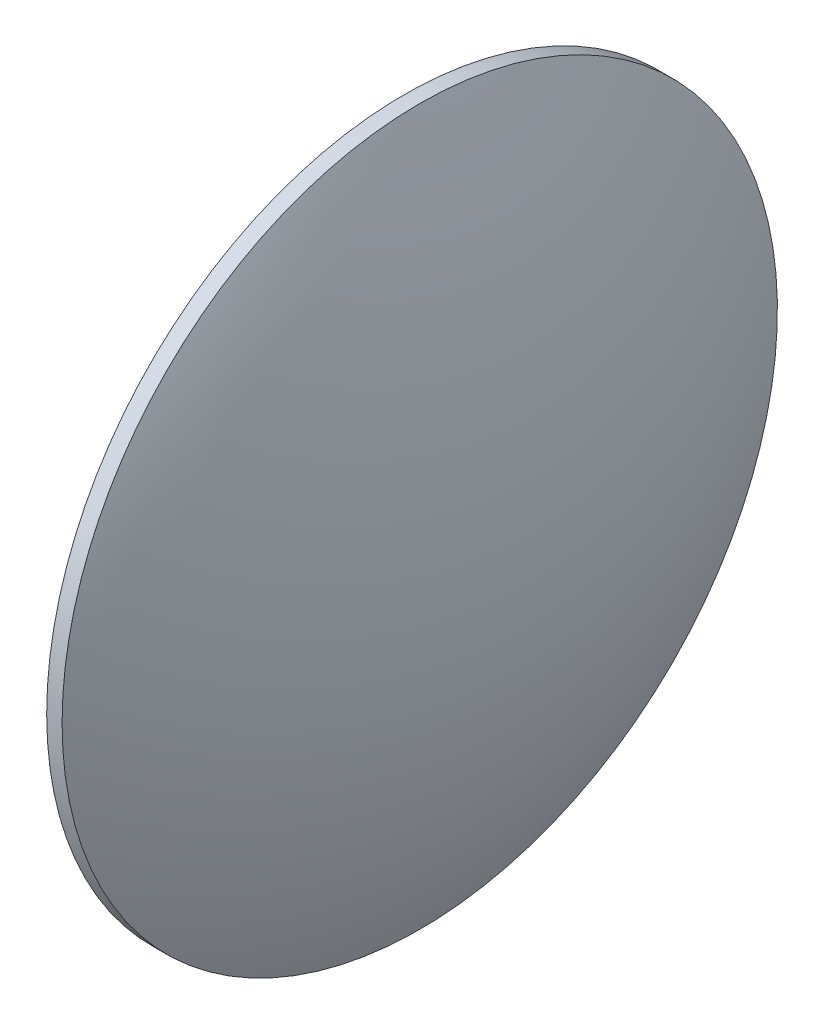
ISO-10303-21;
HEADER;
FILE_DESCRIPTION(('STEP AP214'),'2;1');
FILE_NAME('part.step','',(''),(''),'','','');
FILE_SCHEMA(('AUTOMOTIVE_DESIGN { 1 0 10303 214 1 1 1 1 }'));
ENDSEC;
DATA;
#1=APPLICATION_CONTEXT('core data for automotive mechanical design processes');
#2=APPLICATION_PROTOCOL_DEFINITION('international standard','automotive_design',2000,#1);
#3=PRODUCT_CONTEXT('',#1,'mechanical');
#4=PRODUCT('Part','Part','',(#3));
#5=PRODUCT_RELATED_PRODUCT_CATEGORY('part','',(#4));
#6=PRODUCT_DEFINITION_FORMATION('','',#4);
#7=PRODUCT_DEFINITION_CONTEXT('part definition',#1,'design');
#8=PRODUCT_DEFINITION('design','',#6,#7);
#9=PRODUCT_DEFINITION_SHAPE('','',#8);
#10=(LENGTH_UNIT() NAMED_UNIT(*) SI_UNIT(.MILLI.,.METRE.));
#11=(NAMED_UNIT(*) PLANE_ANGLE_UNIT() SI_UNIT($,.RADIAN.));
#12=(NAMED_UNIT(*) SI_UNIT($,.STERADIAN.) SOLID_ANGLE_UNIT());
#13=UNCERTAINTY_MEASURE_WITH_UNIT(LENGTH_MEASURE(1.E-05),#10,'distance_accuracy_value','');
#14=(GEOMETRIC_REPRESENTATION_CONTEXT(3) GLOBAL_UNCERTAINTY_ASSIGNED_CONTEXT((#13)) GLOBAL_UNIT_ASSIGNED_CONTEXT((#10,
#11,#12)) REPRESENTATION_CONTEXT('',''));
#15=CARTESIAN_POINT('',(0.,0.,0.));
#16=DIRECTION('',(0.,0.,1.));
#17=DIRECTION('',(1.,0.,0.));
#18=AXIS2_PLACEMENT_3D('',#15,#16,#17);
#19=CARTESIAN_POINT('',(146.052361275479,-255.605670350055,0.));
#20=DIRECTION('',(-1.,0.,0.));
#21=DIRECTION('',(0.,1.,0.));
#22=AXIS2_PLACEMENT_3D('',#19,#20,#21);
#23=SPHERICAL_SURFACE('',#22,51.9071052631579);
#24=CARTESIAN_POINT('',(192.829466538637,-255.605670350055,0.));
#25=DIRECTION('',(-1.,0.,0.));
#26=DIRECTION('',(0.,0.,1.));
#27=AXIS2_PLACEMENT_3D('',#24,#25,#26);
#28=CIRCLE('',#27,22.5);
#29=CARTESIAN_POINT('',(192.829466538637,-255.605670350055,22.5));
#30=VERTEX_POINT('',#29);
#31=EDGE_CURVE('E10',#30,#30,#28,.T.);
#32=ORIENTED_EDGE('',*,*,#31,.F.);
#33=EDGE_LOOP('',(#32));
#34=FACE_BOUND('',#33,.T.);
#35=ADVANCED_FACE('F35',(#34),#23,.T.);
#36=CARTESIAN_POINT('',(187.816345069152,-255.605670350055,0.));
#37=DIRECTION('',(-1.,0.,0.));
#38=DIRECTION('',(0.,0.,1.));
#39=AXIS2_PLACEMENT_3D('',#36,#37,#38);
#40=CYLINDRICAL_SURFACE('',#39,22.5);
#41=CARTESIAN_POINT('',(191.859466538637,-255.605670350055,0.));
#42=DIRECTION('',(-1.,0.,0.));
#43=DIRECTION('',(0.,0.,1.));
#44=AXIS2_PLACEMENT_3D('',#41,#42,#43);
#45=CIRCLE('',#44,22.5);
#46=CARTESIAN_POINT('',(191.859466538637,-255.605670350055,22.5));
#47=VERTEX_POINT('',#46);
#48=EDGE_CURVE('E41',#47,#47,#45,.T.);
#49=ORIENTED_EDGE('',*,*,#48,.F.);
#50=EDGE_LOOP('',(#49));
#51=FACE_BOUND('',#50,.T.);
#52=ORIENTED_EDGE('',*,*,#31,.T.);
#53=EDGE_LOOP('',(#52));
#54=FACE_BOUND('',#53,.T.);
#55=ADVANCED_FACE('F49',(#51,#54),#40,.T.);
#56=CARTESIAN_POINT('',(191.859466538637,-255.605670350055,0.));
#57=DIRECTION('',(1.,0.,0.));
#58=DIRECTION('',(0.,0.,-1.));
#59=AXIS2_PLACEMENT_3D('',#56,#57,#58);
#60=PLANE('',#59);
#61=ORIENTED_EDGE('',*,*,#48,.T.);
#62=EDGE_LOOP('',(#61));
#63=FACE_BOUND('',#62,.T.);
#64=ADVANCED_FACE('F47',(#63),#60,.F.);
#65=CLOSED_SHELL('',(#35,#55,#64));
#66=MANIFOLD_SOLID_BREP('B2',#65);
#67=ADVANCED_BREP_SHAPE_REPRESENTATION('',(#18,#66),#14);
#68=SHAPE_DEFINITION_REPRESENTATION(#9,#67);
ENDSEC;
END-ISO-10303-21;
